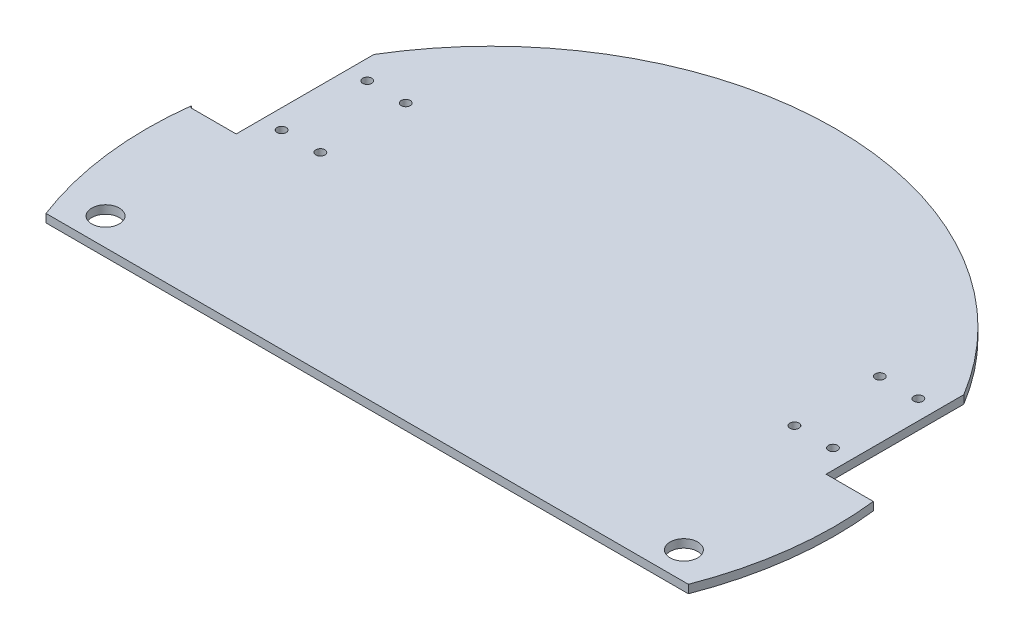
ISO-10303-21;
HEADER;
FILE_DESCRIPTION(('STEP AP214'),'2;1');
FILE_NAME('part.step','',(''),(''),'','','');
FILE_SCHEMA(('AUTOMOTIVE_DESIGN { 1 0 10303 214 1 1 1 1 }'));
ENDSEC;
DATA;
#1=APPLICATION_CONTEXT('core data for automotive mechanical design processes');
#2=APPLICATION_PROTOCOL_DEFINITION('international standard','automotive_design',2000,#1);
#3=PRODUCT_CONTEXT('',#1,'mechanical');
#4=PRODUCT('Part','Part','',(#3));
#5=PRODUCT_RELATED_PRODUCT_CATEGORY('part','',(#4));
#6=PRODUCT_DEFINITION_FORMATION('','',#4);
#7=PRODUCT_DEFINITION_CONTEXT('part definition',#1,'design');
#8=PRODUCT_DEFINITION('design','',#6,#7);
#9=PRODUCT_DEFINITION_SHAPE('','',#8);
#10=(LENGTH_UNIT() NAMED_UNIT(*) SI_UNIT(.MILLI.,.METRE.));
#11=(NAMED_UNIT(*) PLANE_ANGLE_UNIT() SI_UNIT($,.RADIAN.));
#12=(NAMED_UNIT(*) SI_UNIT($,.STERADIAN.) SOLID_ANGLE_UNIT());
#13=UNCERTAINTY_MEASURE_WITH_UNIT(LENGTH_MEASURE(1.E-05),#10,'distance_accuracy_value','');
#14=(GEOMETRIC_REPRESENTATION_CONTEXT(3) GLOBAL_UNCERTAINTY_ASSIGNED_CONTEXT((#13)) GLOBAL_UNIT_ASSIGNED_CONTEXT((#10,
#11,#12)) REPRESENTATION_CONTEXT('',''));
#15=CARTESIAN_POINT('',(0.,0.,0.));
#16=DIRECTION('',(0.,0.,1.));
#17=DIRECTION('',(1.,0.,0.));
#18=AXIS2_PLACEMENT_3D('',#15,#16,#17);
#19=CARTESIAN_POINT('',(-17.8076536899108,3.,0.854894606578442));
#20=DIRECTION('',(0.,-1.,0.));
#21=DIRECTION('',(0.,0.,-1.));
#22=AXIS2_PLACEMENT_3D('',#19,#20,#21);
#23=CYLINDRICAL_SURFACE('',#22,125.);
#24=CARTESIAN_POINT('',(-17.8076536899108,3.,0.854894606578442));
#25=DIRECTION('',(0.,1.,0.));
#26=DIRECTION('',(0.,0.,1.));
#27=AXIS2_PLACEMENT_3D('',#24,#25,#26);
#28=CIRCLE('',#27,125.);
#29=CARTESIAN_POINT('',(89.1923463100892,3.,-63.7670830790356));
#30=VERTEX_POINT('',#29);
#31=CARTESIAN_POINT('',(-124.881226526536,3.,-63.6451053934216));
#32=VERTEX_POINT('',#31);
#33=EDGE_CURVE('E42',#30,#32,#28,.T.);
#34=ORIENTED_EDGE('',*,*,#33,.F.);
#35=DIRECTION('',(0.,-1.,0.));
#36=VECTOR('',#35,1.);
#37=CARTESIAN_POINT('',(89.1923463100892,10.,-63.7670830790356));
#38=LINE('',#37,#36);
#39=CARTESIAN_POINT('',(89.1923463100892,0.,-63.7670830790356));
#40=VERTEX_POINT('',#39);
#41=EDGE_CURVE('E115',#30,#40,#38,.T.);
#42=ORIENTED_EDGE('',*,*,#41,.T.);
#43=CARTESIAN_POINT('',(-17.8076536899108,0.,0.854894606578442));
#44=DIRECTION('',(0.,1.,0.));
#45=DIRECTION('',(0.,0.,1.));
#46=AXIS2_PLACEMENT_3D('',#43,#44,#45);
#47=CIRCLE('',#46,125.);
#48=CARTESIAN_POINT('',(-124.881226526536,0.,-63.6451053934216));
#49=VERTEX_POINT('',#48);
#50=EDGE_CURVE('E58',#40,#49,#47,.T.);
#51=ORIENTED_EDGE('',*,*,#50,.T.);
#52=DIRECTION('',(0.,-1.,0.));
#53=VECTOR('',#52,1.);
#54=CARTESIAN_POINT('',(-124.881226526536,10.,-63.6451053934216));
#55=LINE('',#54,#53);
#56=EDGE_CURVE('E140',#32,#49,#55,.T.);
#57=ORIENTED_EDGE('',*,*,#56,.F.);
#58=EDGE_LOOP('',(#34,#42,#51,#57));
#59=FACE_BOUND('',#58,.T.);
#60=ADVANCED_FACE('F33',(#59),#23,.T.);
#61=CARTESIAN_POINT('',(-141.871934685686,3.,-14.4112175704417));
#62=VERTEX_POINT('',#61);
#63=CARTESIAN_POINT('',(-134.426691586817,3.,45.8548946065784));
#64=VERTEX_POINT('',#63);
#65=EDGE_CURVE('E43',#62,#64,#28,.T.);
#66=ORIENTED_EDGE('',*,*,#65,.F.);
#67=DIRECTION('',(0.,-1.,0.));
#68=VECTOR('',#67,1.);
#69=CARTESIAN_POINT('',(-141.871934685686,3.,-14.4112175704417));
#70=LINE('',#69,#68);
#71=CARTESIAN_POINT('',(-141.871934685686,0.,-14.4112175704417));
#72=VERTEX_POINT('',#71);
#73=EDGE_CURVE('E153',#62,#72,#70,.T.);
#74=ORIENTED_EDGE('',*,*,#73,.T.);
#75=CARTESIAN_POINT('',(-134.426691586817,0.,45.8548946065784));
#76=VERTEX_POINT('',#75);
#77=EDGE_CURVE('E225',#72,#76,#47,.T.);
#78=ORIENTED_EDGE('',*,*,#77,.T.);
#79=DIRECTION('',(0.,-1.,0.));
#80=VECTOR('',#79,1.);
#81=CARTESIAN_POINT('',(-134.426691586817,3.,45.8548946065784));
#82=LINE('',#81,#80);
#83=EDGE_CURVE('E220',#64,#76,#82,.T.);
#84=ORIENTED_EDGE('',*,*,#83,.F.);
#85=EDGE_LOOP('',(#66,#74,#78,#84));
#86=FACE_BOUND('',#85,.T.);
#87=ADVANCED_FACE('F237',(#86),#23,.T.);
#88=CARTESIAN_POINT('',(98.8113842069952,0.,45.8548946065784));
#89=VERTEX_POINT('',#88);
#90=CARTESIAN_POINT('',(106.334191666767,0.,-13.7670830790356));
#91=VERTEX_POINT('',#90);
#92=EDGE_CURVE('E37',#89,#91,#47,.T.);
#93=ORIENTED_EDGE('',*,*,#92,.T.);
#94=DIRECTION('',(0.,-1.,0.));
#95=VECTOR('',#94,1.);
#96=CARTESIAN_POINT('',(106.334191666767,10.,-13.7670830790356));
#97=LINE('',#96,#95);
#98=CARTESIAN_POINT('',(106.334191666767,3.,-13.7670830790356));
#99=VERTEX_POINT('',#98);
#100=EDGE_CURVE('E50',#99,#91,#97,.T.);
#101=ORIENTED_EDGE('',*,*,#100,.F.);
#102=CARTESIAN_POINT('',(98.8113842069952,3.,45.8548946065784));
#103=VERTEX_POINT('',#102);
#104=EDGE_CURVE('E11',#103,#99,#28,.T.);
#105=ORIENTED_EDGE('',*,*,#104,.F.);
#106=DIRECTION('',(0.,-1.,0.));
#107=VECTOR('',#106,1.);
#108=CARTESIAN_POINT('',(98.8113842069952,3.,45.8548946065784));
#109=LINE('',#108,#107);
#110=EDGE_CURVE('E222',#103,#89,#109,.T.);
#111=ORIENTED_EDGE('',*,*,#110,.T.);
#112=EDGE_LOOP('',(#93,#101,#105,#111));
#113=FACE_BOUND('',#112,.T.);
#114=ADVANCED_FACE('F35',(#113),#23,.T.);
#115=CARTESIAN_POINT('',(-17.8076536899108,3.,0.854894606578442));
#116=DIRECTION('',(0.,1.,0.));
#117=DIRECTION('',(0.,0.,1.));
#118=AXIS2_PLACEMENT_3D('',#115,#116,#117);
#119=PLANE('',#118);
#120=DIRECTION('',(0.,0.,1.));
#121=VECTOR('',#120,1.);
#122=CARTESIAN_POINT('',(89.1923463100892,3.,0.854894606578412));
#123=LINE('',#122,#121);
#124=CARTESIAN_POINT('',(89.1923463100892,3.,-13.7670830790356));
#125=VERTEX_POINT('',#124);
#126=EDGE_CURVE('E113',#30,#125,#123,.T.);
#127=ORIENTED_EDGE('',*,*,#126,.F.);
#128=ORIENTED_EDGE('',*,*,#33,.T.);
#129=DIRECTION('',(0.,0.,-1.));
#130=VECTOR('',#129,1.);
#131=CARTESIAN_POINT('',(-124.881226526536,3.,0.854894606578442));
#132=LINE('',#131,#130);
#133=CARTESIAN_POINT('',(-124.881226526536,3.,-13.6451053934216));
#134=VERTEX_POINT('',#133);
#135=EDGE_CURVE('E143',#134,#32,#132,.T.);
#136=ORIENTED_EDGE('',*,*,#135,.F.);
#137=DIRECTION('',(1.,0.,0.));
#138=VECTOR('',#137,1.);
#139=CARTESIAN_POINT('',(-17.8076536899108,3.,-13.6451053934216));
#140=LINE('',#139,#138);
#141=CARTESIAN_POINT('',(-141.357501756476,3.,-13.6451053934216));
#142=VERTEX_POINT('',#141);
#143=EDGE_CURVE('E149',#142,#134,#140,.T.);
#144=ORIENTED_EDGE('',*,*,#143,.F.);
#145=DIRECTION('',(0.557466547763257,0.,0.830199402628619));
#146=VECTOR('',#145,1.);
#147=CARTESIAN_POINT('',(-96.2513232418952,3.,53.5286516829715));
#148=LINE('',#147,#146);
#149=EDGE_CURVE('E151',#62,#142,#148,.T.);
#150=ORIENTED_EDGE('',*,*,#149,.F.);
#151=ORIENTED_EDGE('',*,*,#65,.T.);
#152=DIRECTION('',(1.,0.,0.));
#153=VECTOR('',#152,1.);
#154=CARTESIAN_POINT('',(0.,3.,45.8548946065784));
#155=LINE('',#154,#153);
#156=EDGE_CURVE('E217',#64,#103,#155,.T.);
#157=ORIENTED_EDGE('',*,*,#156,.T.);
#158=ORIENTED_EDGE('',*,*,#104,.T.);
#159=DIRECTION('',(1.,0.,0.));
#160=VECTOR('',#159,1.);
#161=CARTESIAN_POINT('',(-17.8076536899108,3.,-13.7670830790356));
#162=LINE('',#161,#160);
#163=EDGE_CURVE('E128',#125,#99,#162,.T.);
#164=ORIENTED_EDGE('',*,*,#163,.F.);
#165=EDGE_LOOP('',(#127,#128,#136,#144,#150,#151,#157,#158,#164));
#166=FACE_BOUND('',#165,.T.);
#167=CARTESIAN_POINT('',(87.1923463100892,3.,35.8548946065784));
#168=DIRECTION('',(0.,1.,0.));
#169=DIRECTION('',(0.,0.,1.));
#170=AXIS2_PLACEMENT_3D('',#167,#168,#169);
#171=CIRCLE('',#170,5.00000000000001);
#172=CARTESIAN_POINT('',(87.1923463100892,3.,40.8548946065784));
#173=VERTEX_POINT('',#172);
#174=EDGE_CURVE('E159',#173,#173,#171,.T.);
#175=ORIENTED_EDGE('',*,*,#174,.F.);
#176=EDGE_LOOP('',(#175));
#177=FACE_BOUND('',#176,.T.);
#178=CARTESIAN_POINT('',(-122.807653689911,3.,35.8548946065784));
#179=DIRECTION('',(0.,1.,0.));
#180=DIRECTION('',(0.,0.,1.));
#181=AXIS2_PLACEMENT_3D('',#178,#179,#180);
#182=CIRCLE('',#181,5.00000000000001);
#183=CARTESIAN_POINT('',(-122.807653689911,3.,40.8548946065784));
#184=VERTEX_POINT('',#183);
#185=EDGE_CURVE('E165',#184,#184,#182,.T.);
#186=ORIENTED_EDGE('',*,*,#185,.F.);
#187=EDGE_LOOP('',(#186));
#188=FACE_BOUND('',#187,.T.);
#189=CARTESIAN_POINT('',(68.1923463100892,3.,-23.2670830790356));
#190=DIRECTION('',(0.,1.,0.));
#191=DIRECTION('',(0.,0.,1.));
#192=AXIS2_PLACEMENT_3D('',#189,#190,#191);
#193=CIRCLE('',#192,1.65);
#194=CARTESIAN_POINT('',(68.1923463100892,3.,-21.6170830790356));
#195=VERTEX_POINT('',#194);
#196=EDGE_CURVE('E171',#195,#195,#193,.T.);
#197=ORIENTED_EDGE('',*,*,#196,.F.);
#198=EDGE_LOOP('',(#197));
#199=FACE_BOUND('',#198,.T.);
#200=CARTESIAN_POINT('',(82.1923463100892,3.,-23.2670830790356));
#201=DIRECTION('',(0.,1.,0.));
#202=DIRECTION('',(0.,0.,1.));
#203=AXIS2_PLACEMENT_3D('',#200,#201,#202);
#204=CIRCLE('',#203,1.65);
#205=CARTESIAN_POINT('',(82.1923463100892,3.,-21.6170830790356));
#206=VERTEX_POINT('',#205);
#207=EDGE_CURVE('E177',#206,#206,#204,.T.);
#208=ORIENTED_EDGE('',*,*,#207,.F.);
#209=EDGE_LOOP('',(#208));
#210=FACE_BOUND('',#209,.T.);
#211=CARTESIAN_POINT('',(82.1923463100892,3.,-54.2670830790356));
#212=DIRECTION('',(0.,1.,0.));
#213=DIRECTION('',(0.,0.,1.));
#214=AXIS2_PLACEMENT_3D('',#211,#212,#213);
#215=CIRCLE('',#214,1.65);
#216=CARTESIAN_POINT('',(82.1923463100892,3.,-52.6170830790356));
#217=VERTEX_POINT('',#216);
#218=EDGE_CURVE('E183',#217,#217,#215,.T.);
#219=ORIENTED_EDGE('',*,*,#218,.F.);
#220=EDGE_LOOP('',(#219));
#221=FACE_BOUND('',#220,.T.);
#222=CARTESIAN_POINT('',(68.1923463100892,3.,-54.2670830790356));
#223=DIRECTION('',(0.,1.,0.));
#224=DIRECTION('',(0.,0.,1.));
#225=AXIS2_PLACEMENT_3D('',#222,#223,#224);
#226=CIRCLE('',#225,1.65);
#227=CARTESIAN_POINT('',(68.1923463100892,3.,-52.6170830790356));
#228=VERTEX_POINT('',#227);
#229=EDGE_CURVE('E189',#228,#228,#226,.T.);
#230=ORIENTED_EDGE('',*,*,#229,.F.);
#231=EDGE_LOOP('',(#230));
#232=FACE_BOUND('',#231,.T.);
#233=CARTESIAN_POINT('',(-103.807653689911,3.,-23.1451053934216));
#234=DIRECTION('',(0.,1.,0.));
#235=DIRECTION('',(0.,0.,1.));
#236=AXIS2_PLACEMENT_3D('',#233,#234,#235);
#237=CIRCLE('',#236,1.65);
#238=CARTESIAN_POINT('',(-103.807653689911,3.,-21.4951053934216));
#239=VERTEX_POINT('',#238);
#240=EDGE_CURVE('E195',#239,#239,#237,.T.);
#241=ORIENTED_EDGE('',*,*,#240,.F.);
#242=EDGE_LOOP('',(#241));
#243=FACE_BOUND('',#242,.T.);
#244=CARTESIAN_POINT('',(-103.807653689911,3.,-54.1451053934216));
#245=DIRECTION('',(0.,1.,0.));
#246=DIRECTION('',(0.,0.,1.));
#247=AXIS2_PLACEMENT_3D('',#244,#245,#246);
#248=CIRCLE('',#247,1.65);
#249=CARTESIAN_POINT('',(-103.807653689911,3.,-52.4951053934216));
#250=VERTEX_POINT('',#249);
#251=EDGE_CURVE('E201',#250,#250,#248,.T.);
#252=ORIENTED_EDGE('',*,*,#251,.F.);
#253=EDGE_LOOP('',(#252));
#254=FACE_BOUND('',#253,.T.);
#255=CARTESIAN_POINT('',(-117.881226526536,3.,-23.1451926993879));
#256=DIRECTION('',(0.,1.,0.));
#257=DIRECTION('',(0.,0.,1.));
#258=AXIS2_PLACEMENT_3D('',#255,#256,#257);
#259=CIRCLE('',#258,1.65);
#260=CARTESIAN_POINT('',(-117.881226526536,3.,-21.4951926993879));
#261=VERTEX_POINT('',#260);
#262=EDGE_CURVE('E207',#261,#261,#259,.T.);
#263=ORIENTED_EDGE('',*,*,#262,.F.);
#264=EDGE_LOOP('',(#263));
#265=FACE_BOUND('',#264,.T.);
#266=CARTESIAN_POINT('',(-117.807653689911,3.,-54.1451053934216));
#267=DIRECTION('',(0.,1.,0.));
#268=DIRECTION('',(0.,0.,1.));
#269=AXIS2_PLACEMENT_3D('',#266,#267,#268);
#270=CIRCLE('',#269,1.65);
#271=CARTESIAN_POINT('',(-117.807653689911,3.,-52.4951053934216));
#272=VERTEX_POINT('',#271);
#273=EDGE_CURVE('E213',#272,#272,#270,.T.);
#274=ORIENTED_EDGE('',*,*,#273,.F.);
#275=EDGE_LOOP('',(#274));
#276=FACE_BOUND('',#275,.T.);
#277=ADVANCED_FACE('F244',(#166,#177,#188,#199,#210,#221,#232,#243,#254,#265,#276),#119,.T.);
#278=CARTESIAN_POINT('',(-17.8076536899108,0.,0.854894606578442));
#279=DIRECTION('',(0.,1.,0.));
#280=DIRECTION('',(0.,0.,1.));
#281=AXIS2_PLACEMENT_3D('',#278,#279,#280);
#282=PLANE('',#281);
#283=CARTESIAN_POINT('',(87.1923463100892,0.,35.8548946065784));
#284=DIRECTION('',(0.,-1.,0.));
#285=DIRECTION('',(0.,0.,-1.));
#286=AXIS2_PLACEMENT_3D('',#283,#284,#285);
#287=CIRCLE('',#286,5.00000000000001);
#288=CARTESIAN_POINT('',(87.1923463100892,0.,30.8548946065784));
#289=VERTEX_POINT('',#288);
#290=EDGE_CURVE('E156',#289,#289,#287,.T.);
#291=ORIENTED_EDGE('',*,*,#290,.F.);
#292=EDGE_LOOP('',(#291));
#293=FACE_BOUND('',#292,.T.);
#294=CARTESIAN_POINT('',(-122.807653689911,0.,35.8548946065784));
#295=DIRECTION('',(0.,-1.,0.));
#296=DIRECTION('',(0.,0.,-1.));
#297=AXIS2_PLACEMENT_3D('',#294,#295,#296);
#298=CIRCLE('',#297,5.00000000000001);
#299=CARTESIAN_POINT('',(-122.807653689911,0.,30.8548946065784));
#300=VERTEX_POINT('',#299);
#301=EDGE_CURVE('E162',#300,#300,#298,.T.);
#302=ORIENTED_EDGE('',*,*,#301,.F.);
#303=EDGE_LOOP('',(#302));
#304=FACE_BOUND('',#303,.T.);
#305=CARTESIAN_POINT('',(68.1923463100892,0.,-23.2670830790356));
#306=DIRECTION('',(0.,-1.,0.));
#307=DIRECTION('',(0.,0.,-1.));
#308=AXIS2_PLACEMENT_3D('',#305,#306,#307);
#309=CIRCLE('',#308,1.65);
#310=CARTESIAN_POINT('',(68.1923463100892,0.,-24.9170830790356));
#311=VERTEX_POINT('',#310);
#312=EDGE_CURVE('E168',#311,#311,#309,.T.);
#313=ORIENTED_EDGE('',*,*,#312,.F.);
#314=EDGE_LOOP('',(#313));
#315=FACE_BOUND('',#314,.T.);
#316=CARTESIAN_POINT('',(82.1923463100892,0.,-23.2670830790356));
#317=DIRECTION('',(0.,-1.,0.));
#318=DIRECTION('',(0.,0.,-1.));
#319=AXIS2_PLACEMENT_3D('',#316,#317,#318);
#320=CIRCLE('',#319,1.65);
#321=CARTESIAN_POINT('',(82.1923463100892,0.,-24.9170830790356));
#322=VERTEX_POINT('',#321);
#323=EDGE_CURVE('E174',#322,#322,#320,.T.);
#324=ORIENTED_EDGE('',*,*,#323,.F.);
#325=EDGE_LOOP('',(#324));
#326=FACE_BOUND('',#325,.T.);
#327=CARTESIAN_POINT('',(82.1923463100892,0.,-54.2670830790356));
#328=DIRECTION('',(0.,-1.,0.));
#329=DIRECTION('',(0.,0.,-1.));
#330=AXIS2_PLACEMENT_3D('',#327,#328,#329);
#331=CIRCLE('',#330,1.65);
#332=CARTESIAN_POINT('',(82.1923463100892,0.,-55.9170830790356));
#333=VERTEX_POINT('',#332);
#334=EDGE_CURVE('E180',#333,#333,#331,.T.);
#335=ORIENTED_EDGE('',*,*,#334,.F.);
#336=EDGE_LOOP('',(#335));
#337=FACE_BOUND('',#336,.T.);
#338=CARTESIAN_POINT('',(68.1923463100892,0.,-54.2670830790356));
#339=DIRECTION('',(0.,-1.,0.));
#340=DIRECTION('',(0.,0.,-1.));
#341=AXIS2_PLACEMENT_3D('',#338,#339,#340);
#342=CIRCLE('',#341,1.65);
#343=CARTESIAN_POINT('',(68.1923463100892,0.,-55.9170830790356));
#344=VERTEX_POINT('',#343);
#345=EDGE_CURVE('E186',#344,#344,#342,.T.);
#346=ORIENTED_EDGE('',*,*,#345,.F.);
#347=EDGE_LOOP('',(#346));
#348=FACE_BOUND('',#347,.T.);
#349=CARTESIAN_POINT('',(-103.807653689911,0.,-23.1451053934216));
#350=DIRECTION('',(0.,-1.,0.));
#351=DIRECTION('',(0.,0.,-1.));
#352=AXIS2_PLACEMENT_3D('',#349,#350,#351);
#353=CIRCLE('',#352,1.65);
#354=CARTESIAN_POINT('',(-103.807653689911,0.,-24.7951053934216));
#355=VERTEX_POINT('',#354);
#356=EDGE_CURVE('E192',#355,#355,#353,.T.);
#357=ORIENTED_EDGE('',*,*,#356,.F.);
#358=EDGE_LOOP('',(#357));
#359=FACE_BOUND('',#358,.T.);
#360=CARTESIAN_POINT('',(-103.807653689911,0.,-54.1451053934216));
#361=DIRECTION('',(0.,-1.,0.));
#362=DIRECTION('',(0.,0.,-1.));
#363=AXIS2_PLACEMENT_3D('',#360,#361,#362);
#364=CIRCLE('',#363,1.65);
#365=CARTESIAN_POINT('',(-103.807653689911,0.,-55.7951053934216));
#366=VERTEX_POINT('',#365);
#367=EDGE_CURVE('E198',#366,#366,#364,.T.);
#368=ORIENTED_EDGE('',*,*,#367,.F.);
#369=EDGE_LOOP('',(#368));
#370=FACE_BOUND('',#369,.T.);
#371=CARTESIAN_POINT('',(-117.881226526536,0.,-23.1451926993879));
#372=DIRECTION('',(0.,-1.,0.));
#373=DIRECTION('',(0.,0.,-1.));
#374=AXIS2_PLACEMENT_3D('',#371,#372,#373);
#375=CIRCLE('',#374,1.65);
#376=CARTESIAN_POINT('',(-117.881226526536,0.,-24.7951926993879));
#377=VERTEX_POINT('',#376);
#378=EDGE_CURVE('E204',#377,#377,#375,.T.);
#379=ORIENTED_EDGE('',*,*,#378,.F.);
#380=EDGE_LOOP('',(#379));
#381=FACE_BOUND('',#380,.T.);
#382=CARTESIAN_POINT('',(-117.807653689911,0.,-54.1451053934216));
#383=DIRECTION('',(0.,-1.,0.));
#384=DIRECTION('',(0.,0.,-1.));
#385=AXIS2_PLACEMENT_3D('',#382,#383,#384);
#386=CIRCLE('',#385,1.65);
#387=CARTESIAN_POINT('',(-117.807653689911,0.,-55.7951053934216));
#388=VERTEX_POINT('',#387);
#389=EDGE_CURVE('E210',#388,#388,#386,.T.);
#390=ORIENTED_EDGE('',*,*,#389,.F.);
#391=EDGE_LOOP('',(#390));
#392=FACE_BOUND('',#391,.T.);
#393=ORIENTED_EDGE('',*,*,#50,.F.);
#394=DIRECTION('',(0.,0.,-1.));
#395=VECTOR('',#394,1.);
#396=CARTESIAN_POINT('',(89.1923463100892,0.,-63.7670830790356));
#397=LINE('',#396,#395);
#398=CARTESIAN_POINT('',(89.1923463100892,0.,-13.7670830790356));
#399=VERTEX_POINT('',#398);
#400=EDGE_CURVE('E111',#399,#40,#397,.T.);
#401=ORIENTED_EDGE('',*,*,#400,.F.);
#402=DIRECTION('',(-1.,0.,0.));
#403=VECTOR('',#402,1.);
#404=CARTESIAN_POINT('',(89.1923463100892,0.,-13.7670830790356));
#405=LINE('',#404,#403);
#406=EDGE_CURVE('E117',#91,#399,#405,.T.);
#407=ORIENTED_EDGE('',*,*,#406,.F.);
#408=ORIENTED_EDGE('',*,*,#92,.F.);
#409=DIRECTION('',(1.,0.,0.));
#410=VECTOR('',#409,1.);
#411=CARTESIAN_POINT('',(0.,0.,45.8548946065784));
#412=LINE('',#411,#410);
#413=EDGE_CURVE('E216',#76,#89,#412,.T.);
#414=ORIENTED_EDGE('',*,*,#413,.F.);
#415=ORIENTED_EDGE('',*,*,#77,.F.);
#416=DIRECTION('',(-0.557466547763257,0.,-0.830199402628619));
#417=VECTOR('',#416,1.);
#418=CARTESIAN_POINT('',(-141.357501756476,0.,-13.6451053934216));
#419=LINE('',#418,#417);
#420=CARTESIAN_POINT('',(-141.357501756476,0.,-13.6451053934216));
#421=VERTEX_POINT('',#420);
#422=EDGE_CURVE('E138',#421,#72,#419,.T.);
#423=ORIENTED_EDGE('',*,*,#422,.F.);
#424=DIRECTION('',(-1.,0.,0.));
#425=VECTOR('',#424,1.);
#426=CARTESIAN_POINT('',(-124.881226526536,0.,-13.6451053934216));
#427=LINE('',#426,#425);
#428=CARTESIAN_POINT('',(-124.881226526536,0.,-13.6451053934216));
#429=VERTEX_POINT('',#428);
#430=EDGE_CURVE('E135',#429,#421,#427,.T.);
#431=ORIENTED_EDGE('',*,*,#430,.F.);
#432=DIRECTION('',(0.,0.,1.));
#433=VECTOR('',#432,1.);
#434=CARTESIAN_POINT('',(-124.881226526536,0.,-63.6451053934216));
#435=LINE('',#434,#433);
#436=EDGE_CURVE('E132',#49,#429,#435,.T.);
#437=ORIENTED_EDGE('',*,*,#436,.F.);
#438=EDGE_LOOP('',(#393,#401,#407,#408,#414,#415,#423,#431,#437));
#439=FACE_BOUND('',#438,.T.);
#440=ADVANCED_FACE('F123',(#293,#304,#315,#326,#337,#348,#359,#370,#381,#392,#439),#282,.F.);
#441=CARTESIAN_POINT('',(0.,3.,45.8548946065784));
#442=DIRECTION('',(0.,0.,-1.));
#443=DIRECTION('',(-1.,0.,0.));
#444=AXIS2_PLACEMENT_3D('',#441,#442,#443);
#445=PLANE('',#444);
#446=ORIENTED_EDGE('',*,*,#413,.T.);
#447=ORIENTED_EDGE('',*,*,#110,.F.);
#448=ORIENTED_EDGE('',*,*,#156,.F.);
#449=ORIENTED_EDGE('',*,*,#83,.T.);
#450=EDGE_LOOP('',(#446,#447,#448,#449));
#451=FACE_BOUND('',#450,.T.);
#452=ADVANCED_FACE('F231',(#451),#445,.F.);
#453=CARTESIAN_POINT('',(-117.807653689911,10.,-54.1451053934216));
#454=DIRECTION('',(0.,-1.,0.));
#455=DIRECTION('',(0.,0.,-1.));
#456=AXIS2_PLACEMENT_3D('',#453,#454,#455);
#457=CYLINDRICAL_SURFACE('',#456,1.65);
#458=ORIENTED_EDGE('',*,*,#273,.T.);
#459=EDGE_LOOP('',(#458));
#460=FACE_BOUND('',#459,.T.);
#461=ORIENTED_EDGE('',*,*,#389,.T.);
#462=EDGE_LOOP('',(#461));
#463=FACE_BOUND('',#462,.T.);
#464=ADVANCED_FACE('F281',(#460,#463),#457,.F.);
#465=CARTESIAN_POINT('',(-117.881226526536,10.,-23.1451926993879));
#466=DIRECTION('',(0.,-1.,0.));
#467=DIRECTION('',(0.,0.,-1.));
#468=AXIS2_PLACEMENT_3D('',#465,#466,#467);
#469=CYLINDRICAL_SURFACE('',#468,1.65);
#470=ORIENTED_EDGE('',*,*,#262,.T.);
#471=EDGE_LOOP('',(#470));
#472=FACE_BOUND('',#471,.T.);
#473=ORIENTED_EDGE('',*,*,#378,.T.);
#474=EDGE_LOOP('',(#473));
#475=FACE_BOUND('',#474,.T.);
#476=ADVANCED_FACE('F304',(#472,#475),#469,.F.);
#477=CARTESIAN_POINT('',(-103.807653689911,10.,-54.1451053934216));
#478=DIRECTION('',(0.,-1.,0.));
#479=DIRECTION('',(0.,0.,-1.));
#480=AXIS2_PLACEMENT_3D('',#477,#478,#479);
#481=CYLINDRICAL_SURFACE('',#480,1.65);
#482=ORIENTED_EDGE('',*,*,#251,.T.);
#483=EDGE_LOOP('',(#482));
#484=FACE_BOUND('',#483,.T.);
#485=ORIENTED_EDGE('',*,*,#367,.T.);
#486=EDGE_LOOP('',(#485));
#487=FACE_BOUND('',#486,.T.);
#488=ADVANCED_FACE('F314',(#484,#487),#481,.F.);
#489=CARTESIAN_POINT('',(-103.807653689911,10.,-23.1451053934216));
#490=DIRECTION('',(0.,-1.,0.));
#491=DIRECTION('',(0.,0.,-1.));
#492=AXIS2_PLACEMENT_3D('',#489,#490,#491);
#493=CYLINDRICAL_SURFACE('',#492,1.65);
#494=ORIENTED_EDGE('',*,*,#240,.T.);
#495=EDGE_LOOP('',(#494));
#496=FACE_BOUND('',#495,.T.);
#497=ORIENTED_EDGE('',*,*,#356,.T.);
#498=EDGE_LOOP('',(#497));
#499=FACE_BOUND('',#498,.T.);
#500=ADVANCED_FACE('F324',(#496,#499),#493,.F.);
#501=CARTESIAN_POINT('',(68.1923463100892,10.,-54.2670830790356));
#502=DIRECTION('',(0.,-1.,0.));
#503=DIRECTION('',(0.,0.,-1.));
#504=AXIS2_PLACEMENT_3D('',#501,#502,#503);
#505=CYLINDRICAL_SURFACE('',#504,1.65);
#506=ORIENTED_EDGE('',*,*,#229,.T.);
#507=EDGE_LOOP('',(#506));
#508=FACE_BOUND('',#507,.T.);
#509=ORIENTED_EDGE('',*,*,#345,.T.);
#510=EDGE_LOOP('',(#509));
#511=FACE_BOUND('',#510,.T.);
#512=ADVANCED_FACE('F334',(#508,#511),#505,.F.);
#513=CARTESIAN_POINT('',(82.1923463100892,10.,-54.2670830790356));
#514=DIRECTION('',(0.,-1.,0.));
#515=DIRECTION('',(0.,0.,-1.));
#516=AXIS2_PLACEMENT_3D('',#513,#514,#515);
#517=CYLINDRICAL_SURFACE('',#516,1.65);
#518=ORIENTED_EDGE('',*,*,#218,.T.);
#519=EDGE_LOOP('',(#518));
#520=FACE_BOUND('',#519,.T.);
#521=ORIENTED_EDGE('',*,*,#334,.T.);
#522=EDGE_LOOP('',(#521));
#523=FACE_BOUND('',#522,.T.);
#524=ADVANCED_FACE('F344',(#520,#523),#517,.F.);
#525=CARTESIAN_POINT('',(82.1923463100892,10.,-23.2670830790356));
#526=DIRECTION('',(0.,-1.,0.));
#527=DIRECTION('',(0.,0.,-1.));
#528=AXIS2_PLACEMENT_3D('',#525,#526,#527);
#529=CYLINDRICAL_SURFACE('',#528,1.65);
#530=ORIENTED_EDGE('',*,*,#207,.T.);
#531=EDGE_LOOP('',(#530));
#532=FACE_BOUND('',#531,.T.);
#533=ORIENTED_EDGE('',*,*,#323,.T.);
#534=EDGE_LOOP('',(#533));
#535=FACE_BOUND('',#534,.T.);
#536=ADVANCED_FACE('F354',(#532,#535),#529,.F.);
#537=CARTESIAN_POINT('',(68.1923463100892,10.,-23.2670830790356));
#538=DIRECTION('',(0.,-1.,0.));
#539=DIRECTION('',(0.,0.,-1.));
#540=AXIS2_PLACEMENT_3D('',#537,#538,#539);
#541=CYLINDRICAL_SURFACE('',#540,1.65);
#542=ORIENTED_EDGE('',*,*,#196,.T.);
#543=EDGE_LOOP('',(#542));
#544=FACE_BOUND('',#543,.T.);
#545=ORIENTED_EDGE('',*,*,#312,.T.);
#546=EDGE_LOOP('',(#545));
#547=FACE_BOUND('',#546,.T.);
#548=ADVANCED_FACE('F364',(#544,#547),#541,.F.);
#549=CARTESIAN_POINT('',(-122.807653689911,10.,35.8548946065784));
#550=DIRECTION('',(0.,-1.,0.));
#551=DIRECTION('',(0.,0.,-1.));
#552=AXIS2_PLACEMENT_3D('',#549,#550,#551);
#553=CYLINDRICAL_SURFACE('',#552,5.00000000000001);
#554=ORIENTED_EDGE('',*,*,#185,.T.);
#555=EDGE_LOOP('',(#554));
#556=FACE_BOUND('',#555,.T.);
#557=ORIENTED_EDGE('',*,*,#301,.T.);
#558=EDGE_LOOP('',(#557));
#559=FACE_BOUND('',#558,.T.);
#560=ADVANCED_FACE('F374',(#556,#559),#553,.F.);
#561=CARTESIAN_POINT('',(87.1923463100892,10.,35.8548946065784));
#562=DIRECTION('',(0.,-1.,0.));
#563=DIRECTION('',(0.,0.,-1.));
#564=AXIS2_PLACEMENT_3D('',#561,#562,#563);
#565=CYLINDRICAL_SURFACE('',#564,5.00000000000001);
#566=ORIENTED_EDGE('',*,*,#174,.T.);
#567=EDGE_LOOP('',(#566));
#568=FACE_BOUND('',#567,.T.);
#569=ORIENTED_EDGE('',*,*,#290,.T.);
#570=EDGE_LOOP('',(#569));
#571=FACE_BOUND('',#570,.T.);
#572=ADVANCED_FACE('F384',(#568,#571),#565,.F.);
#573=CARTESIAN_POINT('',(-141.357501756476,10.,-13.6451053934216));
#574=DIRECTION('',(-0.830199402628619,0.,0.557466547763257));
#575=DIRECTION('',(0.557466547763257,0.,0.830199402628619));
#576=AXIS2_PLACEMENT_3D('',#573,#574,#575);
#577=PLANE('',#576);
#578=ORIENTED_EDGE('',*,*,#149,.T.);
#579=DIRECTION('',(0.,-1.,0.));
#580=VECTOR('',#579,1.);
#581=CARTESIAN_POINT('',(-141.357501756476,10.,-13.6451053934216));
#582=LINE('',#581,#580);
#583=EDGE_CURVE('E141',#142,#421,#582,.T.);
#584=ORIENTED_EDGE('',*,*,#583,.T.);
#585=ORIENTED_EDGE('',*,*,#422,.T.);
#586=ORIENTED_EDGE('',*,*,#73,.F.);
#587=EDGE_LOOP('',(#578,#584,#585,#586));
#588=FACE_BOUND('',#587,.T.);
#589=ADVANCED_FACE('F240',(#588),#577,.F.);
#590=CARTESIAN_POINT('',(-124.881226526536,10.,-13.6451053934216));
#591=DIRECTION('',(0.,0.,1.));
#592=DIRECTION('',(1.,0.,0.));
#593=AXIS2_PLACEMENT_3D('',#590,#591,#592);
#594=PLANE('',#593);
#595=ORIENTED_EDGE('',*,*,#143,.T.);
#596=DIRECTION('',(0.,-1.,0.));
#597=VECTOR('',#596,1.);
#598=CARTESIAN_POINT('',(-124.881226526536,10.,-13.6451053934216));
#599=LINE('',#598,#597);
#600=EDGE_CURVE('E144',#134,#429,#599,.T.);
#601=ORIENTED_EDGE('',*,*,#600,.T.);
#602=ORIENTED_EDGE('',*,*,#430,.T.);
#603=ORIENTED_EDGE('',*,*,#583,.F.);
#604=EDGE_LOOP('',(#595,#601,#602,#603));
#605=FACE_BOUND('',#604,.T.);
#606=ADVANCED_FACE('F249',(#605),#594,.F.);
#607=CARTESIAN_POINT('',(-124.881226526536,10.,-63.6451053934216));
#608=DIRECTION('',(1.,0.,0.));
#609=DIRECTION('',(0.,0.,-1.));
#610=AXIS2_PLACEMENT_3D('',#607,#608,#609);
#611=PLANE('',#610);
#612=ORIENTED_EDGE('',*,*,#135,.T.);
#613=ORIENTED_EDGE('',*,*,#56,.T.);
#614=ORIENTED_EDGE('',*,*,#436,.T.);
#615=ORIENTED_EDGE('',*,*,#600,.F.);
#616=EDGE_LOOP('',(#612,#613,#614,#615));
#617=FACE_BOUND('',#616,.T.);
#618=ADVANCED_FACE('F251',(#617),#611,.F.);
#619=CARTESIAN_POINT('',(89.1923463100892,10.,-63.7670830790356));
#620=DIRECTION('',(-1.,0.,0.));
#621=DIRECTION('',(0.,0.,1.));
#622=AXIS2_PLACEMENT_3D('',#619,#620,#621);
#623=PLANE('',#622);
#624=ORIENTED_EDGE('',*,*,#126,.T.);
#625=DIRECTION('',(0.,-1.,0.));
#626=VECTOR('',#625,1.);
#627=CARTESIAN_POINT('',(89.1923463100892,10.,-13.7670830790356));
#628=LINE('',#627,#626);
#629=EDGE_CURVE('E108',#125,#399,#628,.T.);
#630=ORIENTED_EDGE('',*,*,#629,.T.);
#631=ORIENTED_EDGE('',*,*,#400,.T.);
#632=ORIENTED_EDGE('',*,*,#41,.F.);
#633=EDGE_LOOP('',(#624,#630,#631,#632));
#634=FACE_BOUND('',#633,.T.);
#635=ADVANCED_FACE('F109',(#634),#623,.F.);
#636=CARTESIAN_POINT('',(89.1923463100892,10.,-13.7670830790356));
#637=DIRECTION('',(0.,0.,1.));
#638=DIRECTION('',(1.,0.,0.));
#639=AXIS2_PLACEMENT_3D('',#636,#637,#638);
#640=PLANE('',#639);
#641=ORIENTED_EDGE('',*,*,#163,.T.);
#642=ORIENTED_EDGE('',*,*,#100,.T.);
#643=ORIENTED_EDGE('',*,*,#406,.T.);
#644=ORIENTED_EDGE('',*,*,#629,.F.);
#645=EDGE_LOOP('',(#641,#642,#643,#644));
#646=FACE_BOUND('',#645,.T.);
#647=ADVANCED_FACE('F118',(#646),#640,.F.);
#648=CLOSED_SHELL('',(#60,#87,#114,#277,#440,#452,#464,#476,#488,#500,#512,#524,#536,#548,#560,
#572,#589,#606,#618,#635,#647));
#649=MANIFOLD_SOLID_BREP('B2',#648);
#650=ADVANCED_BREP_SHAPE_REPRESENTATION('',(#18,#649),#14);
#651=SHAPE_DEFINITION_REPRESENTATION(#9,#650);
ENDSEC;
END-ISO-10303-21;
